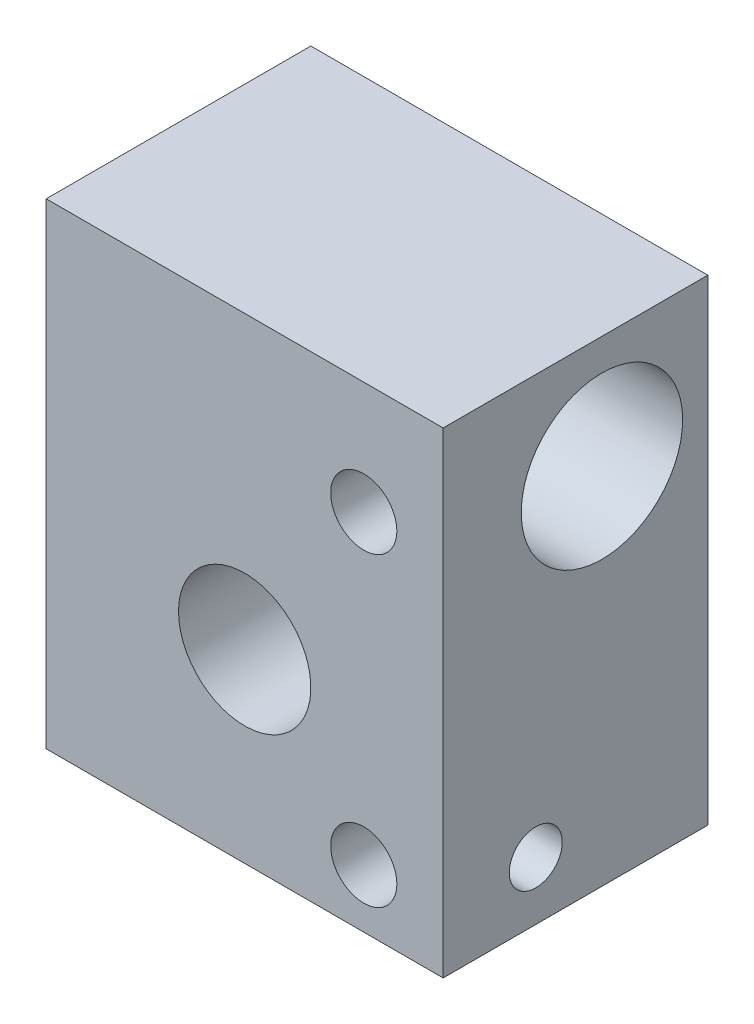
ISO-10303-21;
HEADER;
FILE_DESCRIPTION(('STEP AP214'),'2;1');
FILE_NAME('part.step','',(''),(''),'','','');
FILE_SCHEMA(('AUTOMOTIVE_DESIGN { 1 0 10303 214 1 1 1 1 }'));
ENDSEC;
DATA;
#1=APPLICATION_CONTEXT('core data for automotive mechanical design processes');
#2=APPLICATION_PROTOCOL_DEFINITION('international standard','automotive_design',2000,#1);
#3=PRODUCT_CONTEXT('',#1,'mechanical');
#4=PRODUCT('Part','Part','',(#3));
#5=PRODUCT_RELATED_PRODUCT_CATEGORY('part','',(#4));
#6=PRODUCT_DEFINITION_FORMATION('','',#4);
#7=PRODUCT_DEFINITION_CONTEXT('part definition',#1,'design');
#8=PRODUCT_DEFINITION('design','',#6,#7);
#9=PRODUCT_DEFINITION_SHAPE('','',#8);
#10=(LENGTH_UNIT() NAMED_UNIT(*) SI_UNIT(.MILLI.,.METRE.));
#11=(NAMED_UNIT(*) PLANE_ANGLE_UNIT() SI_UNIT($,.RADIAN.));
#12=(NAMED_UNIT(*) SI_UNIT($,.STERADIAN.) SOLID_ANGLE_UNIT());
#13=UNCERTAINTY_MEASURE_WITH_UNIT(LENGTH_MEASURE(1.E-05),#10,'distance_accuracy_value','');
#14=(GEOMETRIC_REPRESENTATION_CONTEXT(3) GLOBAL_UNCERTAINTY_ASSIGNED_CONTEXT((#13)) GLOBAL_UNIT_ASSIGNED_CONTEXT((#10,
#11,#12)) REPRESENTATION_CONTEXT('',''));
#15=CARTESIAN_POINT('',(0.,0.,0.));
#16=DIRECTION('',(0.,0.,1.));
#17=DIRECTION('',(1.,0.,0.));
#18=AXIS2_PLACEMENT_3D('',#15,#16,#17);
#19=CARTESIAN_POINT('',(7.5,-9.,10.));
#20=DIRECTION('',(-1.,0.,0.));
#21=DIRECTION('',(0.,0.,1.));
#22=AXIS2_PLACEMENT_3D('',#19,#20,#21);
#23=PLANE('',#22);
#24=CARTESIAN_POINT('',(7.5,-6.8,6.5));
#25=DIRECTION('',(1.,0.,0.));
#26=DIRECTION('',(0.,0.,-1.));
#27=AXIS2_PLACEMENT_3D('',#24,#25,#26);
#28=CIRCLE('',#27,0.999999999999998);
#29=CARTESIAN_POINT('',(7.5,-6.8,5.5));
#30=VERTEX_POINT('',#29);
#31=EDGE_CURVE('E109',#30,#30,#28,.T.);
#32=ORIENTED_EDGE('',*,*,#31,.F.);
#33=EDGE_LOOP('',(#32));
#34=FACE_BOUND('',#33,.T.);
#35=CARTESIAN_POINT('',(7.5,4.75,4.));
#36=DIRECTION('',(1.,0.,0.));
#37=DIRECTION('',(0.,0.,-1.));
#38=AXIS2_PLACEMENT_3D('',#35,#36,#37);
#39=CIRCLE('',#38,3.05);
#40=CARTESIAN_POINT('',(7.5,4.75,0.950000000000001));
#41=VERTEX_POINT('',#40);
#42=EDGE_CURVE('E234',#41,#41,#39,.T.);
#43=ORIENTED_EDGE('',*,*,#42,.F.);
#44=EDGE_LOOP('',(#43));
#45=FACE_BOUND('',#44,.T.);
#46=DIRECTION('',(0.,1.,0.));
#47=VECTOR('',#46,1.);
#48=CARTESIAN_POINT('',(7.5,-9.,0.));
#49=LINE('',#48,#47);
#50=CARTESIAN_POINT('',(7.5,-9.,0.));
#51=VERTEX_POINT('',#50);
#52=CARTESIAN_POINT('',(7.5,9.,0.));
#53=VERTEX_POINT('',#52);
#54=EDGE_CURVE('E195',#51,#53,#49,.T.);
#55=ORIENTED_EDGE('',*,*,#54,.T.);
#56=DIRECTION('',(0.,0.,-1.));
#57=VECTOR('',#56,1.);
#58=CARTESIAN_POINT('',(7.5,9.,10.));
#59=LINE('',#58,#57);
#60=CARTESIAN_POINT('',(7.5,9.,10.));
#61=VERTEX_POINT('',#60);
#62=EDGE_CURVE('E140',#61,#53,#59,.T.);
#63=ORIENTED_EDGE('',*,*,#62,.F.);
#64=DIRECTION('',(0.,1.,0.));
#65=VECTOR('',#64,1.);
#66=CARTESIAN_POINT('',(7.5,-9.,10.));
#67=LINE('',#66,#65);
#68=CARTESIAN_POINT('',(7.5,-9.,10.));
#69=VERTEX_POINT('',#68);
#70=EDGE_CURVE('E206',#69,#61,#67,.T.);
#71=ORIENTED_EDGE('',*,*,#70,.F.);
#72=DIRECTION('',(0.,0.,-1.));
#73=VECTOR('',#72,1.);
#74=CARTESIAN_POINT('',(7.5,-9.,10.));
#75=LINE('',#74,#73);
#76=EDGE_CURVE('E210',#69,#51,#75,.T.);
#77=ORIENTED_EDGE('',*,*,#76,.T.);
#78=EDGE_LOOP('',(#55,#63,#71,#77));
#79=FACE_BOUND('',#78,.T.);
#80=ADVANCED_FACE('F38',(#34,#45,#79),#23,.F.);
#81=CARTESIAN_POINT('',(-7.5,9.,10.));
#82=DIRECTION('',(0.,-1.,0.));
#83=DIRECTION('',(0.,0.,-1.));
#84=AXIS2_PLACEMENT_3D('',#81,#82,#83);
#85=PLANE('',#84);
#86=DIRECTION('',(-1.,0.,0.));
#87=VECTOR('',#86,1.);
#88=CARTESIAN_POINT('',(-7.5,9.,0.));
#89=LINE('',#88,#87);
#90=CARTESIAN_POINT('',(-7.5,9.,0.));
#91=VERTEX_POINT('',#90);
#92=EDGE_CURVE('E185',#53,#91,#89,.T.);
#93=ORIENTED_EDGE('',*,*,#92,.T.);
#94=DIRECTION('',(0.,0.,-1.));
#95=VECTOR('',#94,1.);
#96=CARTESIAN_POINT('',(-7.5,9.,10.));
#97=LINE('',#96,#95);
#98=CARTESIAN_POINT('',(-7.5,9.,10.));
#99=VERTEX_POINT('',#98);
#100=EDGE_CURVE('E187',#99,#91,#97,.T.);
#101=ORIENTED_EDGE('',*,*,#100,.F.);
#102=DIRECTION('',(-1.,0.,0.));
#103=VECTOR('',#102,1.);
#104=CARTESIAN_POINT('',(-7.5,9.,10.));
#105=LINE('',#104,#103);
#106=EDGE_CURVE('E220',#61,#99,#105,.T.);
#107=ORIENTED_EDGE('',*,*,#106,.F.);
#108=ORIENTED_EDGE('',*,*,#62,.T.);
#109=EDGE_LOOP('',(#93,#101,#107,#108));
#110=FACE_BOUND('',#109,.T.);
#111=ADVANCED_FACE('F175',(#110),#85,.F.);
#112=CARTESIAN_POINT('',(-7.5,-9.,10.));
#113=DIRECTION('',(1.,0.,0.));
#114=DIRECTION('',(0.,0.,-1.));
#115=AXIS2_PLACEMENT_3D('',#112,#113,#114);
#116=PLANE('',#115);
#117=CARTESIAN_POINT('',(-7.5,4.75,4.));
#118=DIRECTION('',(1.,0.,0.));
#119=DIRECTION('',(0.,0.,-1.));
#120=AXIS2_PLACEMENT_3D('',#117,#118,#119);
#121=CIRCLE('',#120,3.05);
#122=CARTESIAN_POINT('',(-7.5,4.75,0.950000000000001));
#123=VERTEX_POINT('',#122);
#124=EDGE_CURVE('E231',#123,#123,#121,.T.);
#125=ORIENTED_EDGE('',*,*,#124,.T.);
#126=EDGE_LOOP('',(#125));
#127=FACE_BOUND('',#126,.T.);
#128=DIRECTION('',(0.,-1.,0.));
#129=VECTOR('',#128,1.);
#130=CARTESIAN_POINT('',(-7.5,-9.,0.));
#131=LINE('',#130,#129);
#132=CARTESIAN_POINT('',(-7.5,-9.,0.));
#133=VERTEX_POINT('',#132);
#134=EDGE_CURVE('E194',#91,#133,#131,.T.);
#135=ORIENTED_EDGE('',*,*,#134,.T.);
#136=DIRECTION('',(0.,0.,-1.));
#137=VECTOR('',#136,1.);
#138=CARTESIAN_POINT('',(-7.5,-9.,10.));
#139=LINE('',#138,#137);
#140=CARTESIAN_POINT('',(-7.5,-9.,10.));
#141=VERTEX_POINT('',#140);
#142=EDGE_CURVE('E201',#141,#133,#139,.T.);
#143=ORIENTED_EDGE('',*,*,#142,.F.);
#144=DIRECTION('',(0.,-1.,0.));
#145=VECTOR('',#144,1.);
#146=CARTESIAN_POINT('',(-7.5,-9.,10.));
#147=LINE('',#146,#145);
#148=EDGE_CURVE('E200',#99,#141,#147,.T.);
#149=ORIENTED_EDGE('',*,*,#148,.F.);
#150=ORIENTED_EDGE('',*,*,#100,.T.);
#151=EDGE_LOOP('',(#135,#143,#149,#150));
#152=FACE_BOUND('',#151,.T.);
#153=ADVANCED_FACE('F172',(#127,#152),#116,.F.);
#154=CARTESIAN_POINT('',(-7.5,-9.,10.));
#155=DIRECTION('',(0.,1.,0.));
#156=DIRECTION('',(0.,0.,1.));
#157=AXIS2_PLACEMENT_3D('',#154,#155,#156);
#158=PLANE('',#157);
#159=DIRECTION('',(1.,0.,0.));
#160=VECTOR('',#159,1.);
#161=CARTESIAN_POINT('',(-7.5,-9.,0.));
#162=LINE('',#161,#160);
#163=EDGE_CURVE('E204',#133,#51,#162,.T.);
#164=ORIENTED_EDGE('',*,*,#163,.T.);
#165=ORIENTED_EDGE('',*,*,#76,.F.);
#166=DIRECTION('',(1.,0.,0.));
#167=VECTOR('',#166,1.);
#168=CARTESIAN_POINT('',(-7.5,-9.,10.));
#169=LINE('',#168,#167);
#170=EDGE_CURVE('E213',#141,#69,#169,.T.);
#171=ORIENTED_EDGE('',*,*,#170,.F.);
#172=ORIENTED_EDGE('',*,*,#142,.T.);
#173=EDGE_LOOP('',(#164,#165,#171,#172));
#174=FACE_BOUND('',#173,.T.);
#175=ADVANCED_FACE('F165',(#174),#158,.F.);
#176=CARTESIAN_POINT('',(0.,0.,10.));
#177=DIRECTION('',(0.,0.,-1.));
#178=DIRECTION('',(-1.,0.,0.));
#179=AXIS2_PLACEMENT_3D('',#176,#177,#178);
#180=PLANE('',#179);
#181=CARTESIAN_POINT('',(4.5,4.75,10.));
#182=DIRECTION('',(0.,0.,1.));
#183=DIRECTION('',(1.,0.,0.));
#184=AXIS2_PLACEMENT_3D('',#181,#182,#183);
#185=CIRCLE('',#184,1.24999999999999);
#186=CARTESIAN_POINT('',(5.74999999999999,4.75,10.));
#187=VERTEX_POINT('',#186);
#188=EDGE_CURVE('E246',#187,#187,#185,.T.);
#189=ORIENTED_EDGE('',*,*,#188,.F.);
#190=EDGE_LOOP('',(#189));
#191=FACE_BOUND('',#190,.T.);
#192=CARTESIAN_POINT('',(4.5,-6.8,10.));
#193=DIRECTION('',(0.,0.,1.));
#194=DIRECTION('',(1.,0.,0.));
#195=AXIS2_PLACEMENT_3D('',#192,#193,#194);
#196=CIRCLE('',#195,1.24999999999999);
#197=CARTESIAN_POINT('',(5.74999999999999,-6.8,10.));
#198=VERTEX_POINT('',#197);
#199=EDGE_CURVE('E244',#198,#198,#196,.T.);
#200=ORIENTED_EDGE('',*,*,#199,.F.);
#201=EDGE_LOOP('',(#200));
#202=FACE_BOUND('',#201,.T.);
#203=CARTESIAN_POINT('',(0.,-2.,10.));
#204=DIRECTION('',(0.,0.,-1.));
#205=DIRECTION('',(-1.,0.,0.));
#206=AXIS2_PLACEMENT_3D('',#203,#204,#205);
#207=CIRCLE('',#206,2.5);
#208=CARTESIAN_POINT('',(-2.5,-2.,10.));
#209=VERTEX_POINT('',#208);
#210=EDGE_CURVE('E223',#209,#209,#207,.T.);
#211=ORIENTED_EDGE('',*,*,#210,.T.);
#212=EDGE_LOOP('',(#211));
#213=FACE_BOUND('',#212,.T.);
#214=ORIENTED_EDGE('',*,*,#70,.T.);
#215=ORIENTED_EDGE('',*,*,#106,.T.);
#216=ORIENTED_EDGE('',*,*,#148,.T.);
#217=ORIENTED_EDGE('',*,*,#170,.T.);
#218=EDGE_LOOP('',(#214,#215,#216,#217));
#219=FACE_BOUND('',#218,.T.);
#220=ADVANCED_FACE('F162',(#191,#202,#213,#219),#180,.F.);
#221=CARTESIAN_POINT('',(0.,0.,0.));
#222=DIRECTION('',(0.,0.,-1.));
#223=DIRECTION('',(-1.,0.,0.));
#224=AXIS2_PLACEMENT_3D('',#221,#222,#223);
#225=PLANE('',#224);
#226=CARTESIAN_POINT('',(0.,-2.,0.));
#227=DIRECTION('',(0.,0.,-1.));
#228=DIRECTION('',(-1.,0.,0.));
#229=AXIS2_PLACEMENT_3D('',#226,#227,#228);
#230=CIRCLE('',#229,2.5);
#231=CARTESIAN_POINT('',(-2.5,-2.,0.));
#232=VERTEX_POINT('',#231);
#233=EDGE_CURVE('E226',#232,#232,#230,.T.);
#234=ORIENTED_EDGE('',*,*,#233,.F.);
#235=EDGE_LOOP('',(#234));
#236=FACE_BOUND('',#235,.T.);
#237=ORIENTED_EDGE('',*,*,#54,.F.);
#238=ORIENTED_EDGE('',*,*,#163,.F.);
#239=ORIENTED_EDGE('',*,*,#134,.F.);
#240=ORIENTED_EDGE('',*,*,#92,.F.);
#241=EDGE_LOOP('',(#237,#238,#239,#240));
#242=FACE_BOUND('',#241,.T.);
#243=ADVANCED_FACE('F160',(#236,#242),#225,.T.);
#244=CARTESIAN_POINT('',(0.,-2.,10.));
#245=DIRECTION('',(0.,0.,-1.));
#246=DIRECTION('',(-1.,0.,0.));
#247=AXIS2_PLACEMENT_3D('',#244,#245,#246);
#248=CYLINDRICAL_SURFACE('',#247,2.5);
#249=ORIENTED_EDGE('',*,*,#210,.F.);
#250=EDGE_LOOP('',(#249));
#251=FACE_BOUND('',#250,.T.);
#252=ORIENTED_EDGE('',*,*,#233,.T.);
#253=EDGE_LOOP('',(#252));
#254=FACE_BOUND('',#253,.T.);
#255=ADVANCED_FACE('F156',(#251,#254),#248,.F.);
#256=CARTESIAN_POINT('',(-7.5,4.75,4.));
#257=DIRECTION('',(1.,0.,0.));
#258=DIRECTION('',(0.,0.,-1.));
#259=AXIS2_PLACEMENT_3D('',#256,#257,#258);
#260=CYLINDRICAL_SURFACE('',#259,3.05);
#261=CARTESIAN_POINT('',(5.74999999999999,4.75,7.05));
#262=CARTESIAN_POINT('',(5.74999317358084,4.81705105449435,7.0499949013604));
#263=CARTESIAN_POINT('',(5.7445728904159,4.88421220939516,7.04776316601173));
#264=CARTESIAN_POINT('',(5.7230821427269,5.01663531512961,7.03905220749816));
#265=CARTESIAN_POINT('',(5.7069833965083,5.08189174087961,7.0325617055695));
#266=CARTESIAN_POINT('',(5.66482596800735,5.20837429284752,7.01603149034563));
#267=CARTESIAN_POINT('',(5.63880056530878,5.2696130929358,7.00600364451595));
#268=CARTESIAN_POINT('',(5.57766372514542,5.38679775394015,6.98337979201622));
#269=CARTESIAN_POINT('',(5.54255520538643,5.44274530666015,6.97078461030852));
#270=CARTESIAN_POINT('',(5.46243359833868,5.55058268229026,6.94360272183732));
#271=CARTESIAN_POINT('',(5.41704813784625,5.60217961883631,6.92895218720805));
#272=CARTESIAN_POINT('',(5.31844769395315,5.69727980579278,6.8995935820288));
#273=CARTESIAN_POINT('',(5.26522873562099,5.74077892161812,6.88488548598071));
#274=CARTESIAN_POINT('',(5.1494220879687,5.82047635819198,6.85630174305004));
#275=CARTESIAN_POINT('',(5.08651058665788,5.85623272255294,6.84249824263373));
#276=CARTESIAN_POINT('',(4.95491722684178,5.91652509902148,6.81829427065235));
#277=CARTESIAN_POINT('',(4.88623826542879,5.9410667050528,6.80789210323986));
#278=CARTESIAN_POINT('',(4.74842884283273,5.977033698322,6.79235707938262));
#279=CARTESIAN_POINT('',(4.67947149284317,5.98902161527503,6.78699943260884));
#280=CARTESIAN_POINT('',(4.54033187566907,6.00129693566521,6.78151145539133));
#281=CARTESIAN_POINT('',(4.47015027248522,6.00159049579919,6.78137837438494));
#282=CARTESIAN_POINT('',(4.33607409840986,5.99089353762405,6.78616368996563));
#283=CARTESIAN_POINT('',(4.27209740726591,5.98073314256808,6.79071047916049));
#284=CARTESIAN_POINT('',(4.14685271703793,5.95080567936669,6.80371701324258));
#285=CARTESIAN_POINT('',(4.08558521945647,5.93103684064336,6.81217747930138));
#286=CARTESIAN_POINT('',(3.96597856734735,5.88207159424284,6.83224715740189));
#287=CARTESIAN_POINT('',(3.90772757534972,5.85268647565431,6.84391858333761));
#288=CARTESIAN_POINT('',(3.79676189319712,5.78545581744839,6.8690795378448));
#289=CARTESIAN_POINT('',(3.74404935655718,5.7476070046597,6.88256976900067));
#290=CARTESIAN_POINT('',(3.64113506271575,5.66089979031177,6.91118669367846));
#291=CARTESIAN_POINT('',(3.59148817119212,5.61139546177047,6.92635714795841));
#292=CARTESIAN_POINT('',(3.50101833818234,5.50460843164101,6.95569448523891));
#293=CARTESIAN_POINT('',(3.46019733238115,5.44732402821036,6.96986114763168));
#294=CARTESIAN_POINT('',(3.38776019476994,5.32496342854657,6.99598214323011));
#295=CARTESIAN_POINT('',(3.35636271935724,5.25974527572702,7.00788187819974));
#296=CARTESIAN_POINT('',(3.30517803112997,5.12434088842293,7.02771185130719));
#297=CARTESIAN_POINT('',(3.28538461664024,5.05415733016857,7.03564420943661));
#298=CARTESIAN_POINT('',(3.25911499785756,4.91545720041041,7.04625363825052));
#299=CARTESIAN_POINT('',(3.25189372784432,4.84710415103708,7.04922426910946));
#300=CARTESIAN_POINT('',(3.24876092149755,4.71010441371817,7.0505074612745));
#301=CARTESIAN_POINT('',(3.25284627086616,4.64145781182913,7.04882130524732));
#302=CARTESIAN_POINT('',(3.27167121733155,4.50926209998629,7.04117156509262));
#303=CARTESIAN_POINT('',(3.28589367478943,4.44562598291882,7.03541570476584));
#304=CARTESIAN_POINT('',(3.32387605471634,4.32170816248345,7.02042451329165));
#305=CARTESIAN_POINT('',(3.34763719121059,4.26142688721188,7.01118873925112));
#306=CARTESIAN_POINT('',(3.40479928404273,4.14383011012163,6.98977295322551));
#307=CARTESIAN_POINT('',(3.43847544195124,4.08666382302296,6.97751077732146));
#308=CARTESIAN_POINT('',(3.51420811639302,3.97859041874229,6.95135965585715));
#309=CARTESIAN_POINT('',(3.55626807827196,3.92768588879936,6.93747004246777));
#310=CARTESIAN_POINT('',(3.65098440399942,3.82987991098666,6.9083776173988));
#311=CARTESIAN_POINT('',(3.70417275944046,3.78349954211682,6.89315046142814));
#312=CARTESIAN_POINT('',(3.81783195761042,3.70018452435906,6.86397295744693));
#313=CARTESIAN_POINT('',(3.87830425548019,3.66325176747518,6.85002286554325));
#314=CARTESIAN_POINT('',(4.00591935720062,3.59955272757804,6.82491824303052));
#315=CARTESIAN_POINT('',(4.0731350035576,3.57291696039833,6.8138001745101));
#316=CARTESIAN_POINT('',(4.21169404128461,3.53156002386075,6.79614362783963));
#317=CARTESIAN_POINT('',(4.28303413036749,3.51682946022231,6.78960153937764));
#318=CARTESIAN_POINT('',(4.42205571719578,3.50061997017984,6.78237686582237));
#319=CARTESIAN_POINT('',(4.48961071540186,3.49823064874135,6.78129189039514));
#320=CARTESIAN_POINT('',(4.62411541510115,3.50435741732201,6.78404131006805));
#321=CARTESIAN_POINT('',(4.6910652011546,3.51287195937366,6.7878750068888));
#322=CARTESIAN_POINT('',(4.8194595845332,3.53980857539514,6.79966724973414));
#323=CARTESIAN_POINT('',(4.88101694579431,3.55778270632242,6.80743875303861));
#324=CARTESIAN_POINT('',(5.00026093044537,3.60269826055876,6.82609039777681));
#325=CARTESIAN_POINT('',(5.0579464682445,3.62964218632339,6.83697140660187));
#326=CARTESIAN_POINT('',(5.17152052867124,3.69356546820026,6.86141244323642));
#327=CARTESIAN_POINT('',(5.22710231558399,3.73104304994741,6.87509264152988));
#328=CARTESIAN_POINT('',(5.33147333634056,3.81425954659735,6.90324259102355));
#329=CARTESIAN_POINT('',(5.38026033074679,3.8600011738197,6.91771260035406));
#330=CARTESIAN_POINT('',(5.47314082024466,3.96222488066987,6.94701985281455));
#331=CARTESIAN_POINT('',(5.51667265144533,4.0192324065468,6.961812751821));
#332=CARTESIAN_POINT('',(5.59357367951555,4.14029737005191,6.98908126299053));
#333=CARTESIAN_POINT('',(5.6269382146159,4.20435802331352,7.00155581115557));
#334=CARTESIAN_POINT('',(5.68180811191665,4.33663629870453,7.02258806460315));
#335=CARTESIAN_POINT('',(5.70351052450805,4.40476171520484,7.03121040731175));
#336=CARTESIAN_POINT('',(5.73495872650017,4.54399616753341,7.04383134859934));
#337=CARTESIAN_POINT('',(5.74474216568277,4.61509507070934,7.04784450441534));
#338=CARTESIAN_POINT('',(5.74946289651355,4.70760124338892,7.04978053015449));
#339=CARTESIAN_POINT('',(5.75000215885384,4.72879511590617,7.05000161244387));
#340=CARTESIAN_POINT('',(5.74999999999999,4.75,7.05));
#341=B_SPLINE_CURVE_WITH_KNOTS('',3,(#261,#262,#263,#264,#265,#266,#267,#268,#269,#270,#271,
#272,#273,#274,#275,#276,#277,#278,#279,#280,#281,#282,#283,#284,#285,#286,#287,#288,#289,#290,
#291,#292,#293,#294,#295,#296,#297,#298,#299,#300,#301,#302,#303,#304,#305,#306,#307,#308,#309,
#310,#311,#312,#313,#314,#315,#316,#317,#318,#319,#320,#321,#322,#323,#324,#325,#326,#327,#328,
#329,#330,#331,#332,#333,#334,#335,#336,#337,#338,#339,#340),.UNSPECIFIED.,.T.,.F.,(4,2,2,2,2,2,
2,2,2,2,2,2,2,2,2,2,2,2,2,2,2,2,2,2,2,2,2,2,2,2,2,2,2,2,2,2,2,2,2,4),(0.,0.201094311180327,
0.402723354574274,0.60368228554281,0.804576743863707,1.01444492091329,1.22441996030868,
1.44431409976959,1.66409843594336,1.87354721803841,2.08288573073389,2.27679448285735,
2.47073898070664,2.66874390795883,2.86682554265503,3.08105274490332,3.29532688370776,
3.51424468844056,3.73304538781654,3.93837132545348,4.14364071369572,4.33912550528581,
4.53463518488672,4.73618655641969,4.93782092740471,5.15341391236424,5.36905003881043,
5.58733616568886,5.80544987646513,6.00721727204662,6.20895602688514,6.40190297186301,
6.59490379169176,6.79928960640031,7.00374262427848,7.22240178249367,7.44116104698124,
7.65609749208749,7.87035321839582,7.93394925864703),.UNSPECIFIED.);
#342=CARTESIAN_POINT('',(5.74999999999999,4.75,7.05));
#343=VERTEX_POINT('',#342);
#344=EDGE_CURVE('E141',#343,#343,#341,.T.);
#345=ORIENTED_EDGE('',*,*,#344,.T.);
#346=EDGE_LOOP('',(#345));
#347=FACE_BOUND('',#346,.T.);
#348=ORIENTED_EDGE('',*,*,#124,.F.);
#349=EDGE_LOOP('',(#348));
#350=FACE_BOUND('',#349,.T.);
#351=ORIENTED_EDGE('',*,*,#42,.T.);
#352=EDGE_LOOP('',(#351));
#353=FACE_BOUND('',#352,.T.);
#354=ADVANCED_FACE('F150',(#347,#350,#353),#260,.F.);
#355=CARTESIAN_POINT('',(4.5,-6.8,6.));
#356=DIRECTION('',(0.,0.,1.));
#357=DIRECTION('',(1.,0.,0.));
#358=AXIS2_PLACEMENT_3D('',#355,#356,#357);
#359=CONICAL_SURFACE('',#358,1.25,1.02974425867665);
#360=CARTESIAN_POINT('',(4.5,-6.8,5.24892422621555));
#361=VERTEX_POINT('',#360);
#362=VERTEX_LOOP('',#361);
#363=FACE_BOUND('',#362,.T.);
#364=CARTESIAN_POINT('',(4.5,-6.8,6.));
#365=DIRECTION('',(0.,0.,1.));
#366=DIRECTION('',(1.,0.,0.));
#367=AXIS2_PLACEMENT_3D('',#364,#365,#366);
#368=CIRCLE('',#367,1.25);
#369=CARTESIAN_POINT('',(3.598612181134,-7.66602540378443,6.));
#370=VERTEX_POINT('',#369);
#371=CARTESIAN_POINT('',(5.40138781886869,-7.66602540378681,6.00000000000196));
#372=VERTEX_POINT('',#371);
#373=EDGE_CURVE('E243',#370,#372,#368,.T.);
#374=ORIENTED_EDGE('',*,*,#373,.T.);
#375=CARTESIAN_POINT('',(5.49028641707355,-7.69312930754734,6.0502));
#376=CARTESIAN_POINT('',(5.4620540291597,-7.68516229364402,6.03439446403427));
#377=CARTESIAN_POINT('',(5.43397441822092,-7.67667040293627,6.01856440625544));
#378=CARTESIAN_POINT('',(5.37820933805071,-7.65846567832842,5.98679857880335));
#379=CARTESIAN_POINT('',(5.35052460000254,-7.64875084220868,5.97086267732073));
#380=CARTESIAN_POINT('',(5.29534164443274,-7.62780610981277,5.93865263805377));
#381=CARTESIAN_POINT('',(5.26785172041543,-7.6165565790724,5.92237691803523));
#382=CARTESIAN_POINT('',(5.21372068820972,-7.59240944996764,5.88967177107602));
#383=CARTESIAN_POINT('',(5.18707899740181,-7.5795130147024,5.87324246012328));
#384=CARTESIAN_POINT('',(5.13220243909832,-7.55021227801001,5.83836852135706));
#385=CARTESIAN_POINT('',(5.10410431543777,-7.53357989189848,5.8198971567474));
#386=CARTESIAN_POINT('',(5.05034517125699,-7.49710879666876,5.78255861572174));
#387=CARTESIAN_POINT('',(5.02467984624535,-7.47727592504741,5.76369221334503));
#388=CARTESIAN_POINT('',(4.98483989175455,-7.43999201796968,5.73135380836441));
#389=CARTESIAN_POINT('',(4.96954941989286,-7.4236625107789,5.71799347162254));
#390=CARTESIAN_POINT('',(4.94218478884379,-7.38857975994309,5.6912618305678));
#391=CARTESIAN_POINT('',(4.93009685493828,-7.36983742938766,5.67789082979815));
#392=CARTESIAN_POINT('',(4.91016740799821,-7.329590146974,5.65140304199133));
#393=CARTESIAN_POINT('',(4.90238168548031,-7.3080531773224,5.63829162851512));
#394=CARTESIAN_POINT('',(4.89169708291768,-7.26309379111954,5.61331666161574));
#395=CARTESIAN_POINT('',(4.88881009238113,-7.23966693149489,5.60145620952708));
#396=CARTESIAN_POINT('',(4.88623771053257,-7.18102854252964,5.57464593497841));
#397=CARTESIAN_POINT('',(4.8886037228914,-7.14530002689939,5.56074189203022));
#398=CARTESIAN_POINT('',(4.89581292295022,-7.07266926803107,5.53712400838137));
#399=CARTESIAN_POINT('',(4.90066989969421,-7.03576157518701,5.52743405299092));
#400=CARTESIAN_POINT('',(4.91006860539325,-6.95380542606474,5.51086100553405));
#401=CARTESIAN_POINT('',(4.91437678220478,-6.90853802728334,5.50485597158092));
#402=CARTESIAN_POINT('',(4.9184748067492,-6.81754799344687,5.49912238604378));
#403=CARTESIAN_POINT('',(4.91828328292789,-6.77182801826922,5.49936795774198));
#404=CARTESIAN_POINT('',(4.91341881342609,-6.67863261058294,5.50622854677725));
#405=CARTESIAN_POINT('',(4.90849830019974,-6.63120016203335,5.51319551359828));
#406=CARTESIAN_POINT('',(4.8974167784806,-6.53776947303589,5.53380349357297));
#407=CARTESIAN_POINT('',(4.89125185371857,-6.4917763035517,5.54746577626934));
#408=CARTESIAN_POINT('',(4.88715963497418,-6.42244524242514,5.57365031385066));
#409=CARTESIAN_POINT('',(4.88674774685179,-6.39841640858867,5.58380701297793));
#410=CARTESIAN_POINT('',(4.88976593975288,-6.3515349652331,5.60582909571334));
#411=CARTESIAN_POINT('',(4.89316735273016,-6.32867491195563,5.61768115280812));
#412=CARTESIAN_POINT('',(4.90481955461782,-6.28460383870021,5.642669092288));
#413=CARTESIAN_POINT('',(4.91312257269359,-6.26341340810177,5.65581751190304));
#414=CARTESIAN_POINT('',(4.93411194219538,-6.22351706477168,5.68253382279197));
#415=CARTESIAN_POINT('',(4.94682115498955,-6.20482482880032,5.69610355897556));
#416=CARTESIAN_POINT('',(4.98149614630583,-6.16232995685965,5.72903491275924));
#417=CARTESIAN_POINT('',(5.00508221426013,-6.13985006830772,5.74834355388397));
#418=CARTESIAN_POINT('',(5.05581374943648,-6.09868488061901,5.78659230699454));
#419=CARTESIAN_POINT('',(5.08298397356535,-6.08002851866166,5.80552869364956));
#420=CARTESIAN_POINT('',(5.14072146790836,-6.04479770679221,5.84396632214518));
#421=CARTESIAN_POINT('',(5.1713904277386,-6.02837263772575,5.86344892060987));
#422=CARTESIAN_POINT('',(5.23412643971758,-5.99799989181846,5.90217002760717));
#423=CARTESIAN_POINT('',(5.26619554023356,-5.98405600718381,5.92140812147574));
#424=CARTESIAN_POINT('',(5.3300143351173,-5.95868810757523,5.95899211536545));
#425=CARTESIAN_POINT('',(5.36173093611331,-5.94718922450714,5.97734442596747));
#426=CARTESIAN_POINT('',(5.4256642289682,-5.92585951930255,6.0138744249624));
#427=CARTESIAN_POINT('',(5.45787881496915,-5.91602307251018,6.03205249756596));
#428=CARTESIAN_POINT('',(5.49028641707356,-5.90687069245265,6.05019999999999));
#429=B_SPLINE_CURVE_WITH_KNOTS('',3,(#375,#376,#377,#378,#379,#380,#381,#382,#383,#384,#385,
#386,#387,#388,#389,#390,#391,#392,#393,#394,#395,#396,#397,#398,#399,#400,#401,#402,#403,#404,
#405,#406,#407,#408,#409,#410,#411,#412,#413,#414,#415,#416,#417,#418,#419,#420,#421,#422,#423,
#424,#425,#426,#427,#428),.UNSPECIFIED.,.F.,.F.,(4,2,2,2,2,2,2,2,2,2,2,2,2,2,2,2,2,2,2,2,2,2,2,
2,2,2,4),(0.,0.0999728954722889,0.200111649914622,0.301678803220385,0.403174619034599,
0.515584481665867,0.627791585764168,0.705740491157839,0.783348470749543,0.861940559971286,
0.940723125374583,1.05531115599276,1.17054046158092,1.30757349647233,1.44403932453253,
1.58806182841255,1.73254485532535,1.81057795926005,1.88802832841069,1.96631925883886,
2.04502263303189,2.15802352730949,2.27185038942399,2.39132944073084,2.51098956226303,
2.62616392516715,2.74094044998118),.UNSPECIFIED.);
#430=CARTESIAN_POINT('',(5.401387818866,-5.93397459621556,6.));
#431=VERTEX_POINT('',#430);
#432=EDGE_CURVE('E11',#372,#431,#429,.T.);
#433=ORIENTED_EDGE('',*,*,#432,.T.);
#434=CARTESIAN_POINT('',(3.59861218113131,-5.93397459621319,6.00000000000196));
#435=VERTEX_POINT('',#434);
#436=EDGE_CURVE('E238',#431,#435,#368,.T.);
#437=ORIENTED_EDGE('',*,*,#436,.T.);
#438=CARTESIAN_POINT('',(3.50971358292644,-5.90687069245266,6.0502));
#439=CARTESIAN_POINT('',(3.53331315066842,-5.91352483721161,6.03699153619936));
#440=CARTESIAN_POINT('',(3.5567997123455,-5.92055093156863,6.02376501618166));
#441=CARTESIAN_POINT('',(3.60349741941,-5.9354342598509,5.99724961432135));
#442=CARTESIAN_POINT('',(3.62670833949662,-5.943292127758,5.98396069239589));
#443=CARTESIAN_POINT('',(3.69717031261121,-5.96872321181211,5.94319816564678));
#444=CARTESIAN_POINT('',(3.7438358110887,-5.98776882275197,5.91561372999426));
#445=CARTESIAN_POINT('',(3.83471240297246,-6.03095640395233,5.85981688611285));
#446=CARTESIAN_POINT('',(3.87891676344681,-6.05511156272037,5.83160302516138));
#447=CARTESIAN_POINT('',(3.94083716089381,-6.09681482391588,5.78872178686289));
#448=CARTESIAN_POINT('',(3.96066329263914,-6.11154589536983,5.77440315102412));
#449=CARTESIAN_POINT('',(3.99813510882635,-6.14332035661841,5.74552415052808));
#450=CARTESIAN_POINT('',(4.01578567575378,-6.16035838166081,5.73096441352294));
#451=CARTESIAN_POINT('',(4.04652590778618,-6.19591099573206,5.70278607647913));
#452=CARTESIAN_POINT('',(4.05985910623184,-6.21421741426561,5.68917928098483));
#453=CARTESIAN_POINT('',(4.08226510274055,-6.2533626627292,5.66229859506211));
#454=CARTESIAN_POINT('',(4.09136422741643,-6.27418480156528,5.64902314678261));
#455=CARTESIAN_POINT('',(4.10464310673414,-6.31793974424823,5.62349687802884));
#456=CARTESIAN_POINT('',(4.10881781004169,-6.34087468940767,5.61124712162209));
#457=CARTESIAN_POINT('',(4.11306265600131,-6.38806657508964,5.58840380415463));
#458=CARTESIAN_POINT('',(4.11309881514464,-6.41233282411698,5.57782466777655));
#459=CARTESIAN_POINT('',(4.11081909538787,-6.46046097284519,5.55906713984957));
#460=CARTESIAN_POINT('',(4.10859993826292,-6.48429842321439,5.55080787372999));
#461=CARTESIAN_POINT('',(4.10335614543742,-6.53246306784323,5.5361231670742));
#462=CARTESIAN_POINT('',(4.1003306042383,-6.55679078406327,5.52969980500596));
#463=CARTESIAN_POINT('',(4.09451085196856,-6.60579562257214,5.51871894904032));
#464=CARTESIAN_POINT('',(4.09171580951763,-6.63047107603481,5.51415449234926));
#465=CARTESIAN_POINT('',(4.08702679450586,-6.68017771334998,5.50688722680716));
#466=CARTESIAN_POINT('',(4.08513254220297,-6.70520878427462,5.50418383988055));
#467=CARTESIAN_POINT('',(4.08254750308201,-6.75738125016416,5.5005412204046));
#468=CARTESIAN_POINT('',(4.08195889631627,-6.78453870485979,5.49975135089749));
#469=CARTESIAN_POINT('',(4.08241996599582,-6.83881884917334,5.50038504756375));
#470=CARTESIAN_POINT('',(4.08347004507912,-6.86594152860778,5.50180915772903));
#471=CARTESIAN_POINT('',(4.08697842937304,-6.92002793067094,5.5068557657891));
#472=CARTESIAN_POINT('',(4.0894441853843,-6.94699004361226,5.51048990123161));
#473=CARTESIAN_POINT('',(4.09516019310819,-7.00043858924834,5.51991792137252));
#474=CARTESIAN_POINT('',(4.09841040229522,-7.02692504764496,5.52571168900542));
#475=CARTESIAN_POINT('',(4.10519576081253,-7.08368196745147,5.54056108147484));
#476=CARTESIAN_POINT('',(4.10868992530325,-7.11385875777519,5.54999633842318));
#477=CARTESIAN_POINT('',(4.11285630884389,-7.17325822177271,5.57174106146463));
#478=CARTESIAN_POINT('',(4.11354654398704,-7.20248578590847,5.58403163962699));
#479=CARTESIAN_POINT('',(4.1096980334543,-7.25174952014176,5.60755661353824));
#480=CARTESIAN_POINT('',(4.10650824550244,-7.2721535088778,5.61819452914818));
#481=CARTESIAN_POINT('',(4.09631900767154,-7.31145889668883,5.64039608881511));
#482=CARTESIAN_POINT('',(4.08932129327637,-7.33036097577355,5.65195930911316));
#483=CARTESIAN_POINT('',(4.07187333548009,-7.36609999506259,5.67538611754454));
#484=CARTESIAN_POINT('',(4.06143983303491,-7.3829464164912,5.6872479966086));
#485=CARTESIAN_POINT('',(4.0379304302771,-7.41469361637308,5.71098474345566));
#486=CARTESIAN_POINT('',(4.02484833016169,-7.42958969221195,5.72285957546288));
#487=CARTESIAN_POINT('',(3.98245149583499,-7.47213854501448,5.75863019433972));
#488=CARTESIAN_POINT('',(3.95030629956501,-7.49711016597753,5.78229754158439));
#489=CARTESIAN_POINT('',(3.88231649195085,-7.54225642438731,5.82909749644401));
#490=CARTESIAN_POINT('',(3.84644852850505,-7.5623977869094,5.85222545652559));
#491=CARTESIAN_POINT('',(3.76145323607756,-7.60471990904869,5.90510677052084));
#492=CARTESIAN_POINT('',(3.71162145890342,-7.62564542244421,5.93472675232658));
#493=CARTESIAN_POINT('',(3.636071292196,-7.65346919608147,5.97858123510041));
#494=CARTESIAN_POINT('',(3.61102171575906,-7.66207715135555,5.9929551794052));
#495=CARTESIAN_POINT('',(3.56059863176369,-7.67831041892385,6.02162556712644));
#496=CARTESIAN_POINT('',(3.53522548724744,-7.68593674144481,6.03592207547788));
#497=CARTESIAN_POINT('',(3.50971358292644,-7.69312930754734,6.0502));
#498=B_SPLINE_CURVE_WITH_KNOTS('',3,(#438,#439,#440,#441,#442,#443,#444,#445,#446,#447,#448,
#449,#450,#451,#452,#453,#454,#455,#456,#457,#458,#459,#460,#461,#462,#463,#464,#465,#466,#467,
#468,#469,#470,#471,#472,#473,#474,#475,#476,#477,#478,#479,#480,#481,#482,#483,#484,#485,#486,
#487,#488,#489,#490,#491,#492,#493,#494,#495,#496,#497),.UNSPECIFIED.,.F.,.F.,(4,2,2,2,2,2,2,2,
2,2,2,2,2,2,2,2,2,2,2,2,2,2,2,2,2,2,2,2,2,4),(0.,0.0835520453506485,0.167168239405998,
0.339378728614747,0.512039264477075,0.597570075986015,0.682905298970882,0.761806801456588,
0.840210929777046,0.918695413123635,0.997824323169111,1.07369719179067,1.14965562058719,
1.22532686000053,1.30097458419883,1.38236014465604,1.46376570533486,1.54560368850048,
1.62743723618381,1.72272259273378,1.81739473431565,1.88674994840292,1.95607357990292,
2.02506430849321,2.09421843665384,2.23466803413924,2.37605903144819,2.5606240898532,
2.65102370647571,2.74132953346726),.UNSPECIFIED.);
#499=EDGE_CURVE('E51',#435,#370,#498,.T.);
#500=ORIENTED_EDGE('',*,*,#499,.T.);
#501=EDGE_LOOP('',(#374,#433,#437,#500));
#502=FACE_BOUND('',#501,.T.);
#503=ADVANCED_FACE('F147',(#363,#502),#359,.F.);
#504=CARTESIAN_POINT('',(4.5,-6.8,10.));
#505=DIRECTION('',(0.,0.,1.));
#506=DIRECTION('',(1.,0.,0.));
#507=AXIS2_PLACEMENT_3D('',#504,#505,#506);
#508=CYLINDRICAL_SURFACE('',#507,1.24999999999999);
#509=ORIENTED_EDGE('',*,*,#373,.F.);
#510=CARTESIAN_POINT('',(3.59861218113401,-7.66602540378443,6.));
#511=CARTESIAN_POINT('',(3.6184739762057,-7.68675902626416,6.03596487697014));
#512=CARTESIAN_POINT('',(3.63792426677372,-7.70550837472696,6.07356604043001));
#513=CARTESIAN_POINT('',(3.67420457060918,-7.73869615813151,6.15254086986226));
#514=CARTESIAN_POINT('',(3.69099237800154,-7.75306795614247,6.19396143451628));
#515=CARTESIAN_POINT('',(3.71662484017291,-7.774191046944,6.27147824029317));
#516=CARTESIAN_POINT('',(3.72638490183204,-7.78188898138144,6.30699782754954));
#517=CARTESIAN_POINT('',(3.74119250823732,-7.79337834014281,6.37944342339025));
#518=CARTESIAN_POINT('',(3.74626821333322,-7.7971931227873,6.41635962027606));
#519=CARTESIAN_POINT('',(3.75087623406768,-7.80066203387391,6.49104013185147));
#520=CARTESIAN_POINT('',(3.7503659702569,-7.80028420352463,6.52880876791995));
#521=CARTESIAN_POINT('',(3.74379868009988,-7.79532595045897,6.60363042555023));
#522=CARTESIAN_POINT('',(3.73772850144248,-7.79073556263663,6.64068153745415));
#523=CARTESIAN_POINT('',(3.71917407194171,-7.7762048970141,6.72156369670487));
#524=CARTESIAN_POINT('',(3.70551473903188,-7.7652582085766,6.76493288121588));
#525=CARTESIAN_POINT('',(3.67391866748519,-7.7383604281203,6.84844802500106));
#526=CARTESIAN_POINT('',(3.65597022712357,-7.72239560717476,6.88858475769217));
#527=CARTESIAN_POINT('',(3.60917119928421,-7.67771680229838,6.98318071024624));
#528=CARTESIAN_POINT('',(3.57907694975281,-7.64650740694967,7.03584310834097));
#529=CARTESIAN_POINT('',(3.5183559128812,-7.57529354321466,7.13452506969512));
#530=CARTESIAN_POINT('',(3.4877285307973,-7.53527858397908,7.18053659992188));
#531=CARTESIAN_POINT('',(3.42850448445096,-7.44599465399415,7.26586751507779));
#532=CARTESIAN_POINT('',(3.39994062620079,-7.3966085923144,7.30508869960434));
#533=CARTESIAN_POINT('',(3.34824880857564,-7.28936992436963,7.37439063704452));
#534=CARTESIAN_POINT('',(3.32510309630992,-7.23154600583372,7.40450133866137));
#535=CARTESIAN_POINT('',(3.29321706824316,-7.1287352289244,7.4454787311362));
#536=CARTESIAN_POINT('',(3.28223911477027,-7.08565789198627,7.45941959553146));
#537=CARTESIAN_POINT('',(3.2648228483799,-6.99714123564449,7.48143202454589));
#538=CARTESIAN_POINT('',(3.25838106982787,-6.95170374795623,7.48950807003057));
#539=CARTESIAN_POINT('',(3.25055997532031,-6.85954328009454,7.49930431849854));
#540=CARTESIAN_POINT('',(3.24919867951823,-6.81281631522798,7.50100189760592));
#541=CARTESIAN_POINT('',(3.25171166139105,-6.7197235050632,7.49786005964921));
#542=CARTESIAN_POINT('',(3.25558637936792,-6.67335769046427,7.49302009283597));
#543=CARTESIAN_POINT('',(3.26789644071195,-6.58478275906894,7.47754770761949));
#544=CARTESIAN_POINT('',(3.27608478095272,-6.54248278388333,7.46722878915105));
#545=CARTESIAN_POINT('',(3.29626920480038,-6.46041183970799,7.44155751906085));
#546=CARTESIAN_POINT('',(3.30826626745011,-6.42064152413306,7.42620387321483));
#547=CARTESIAN_POINT('',(3.33662734477677,-6.34061610275749,7.38943026475194));
#548=CARTESIAN_POINT('',(3.3532975400543,-6.30067249548245,7.36757318159561));
#549=CARTESIAN_POINT('',(3.38933145605348,-6.22495505790292,7.3193541579962));
#550=CARTESIAN_POINT('',(3.40869664925647,-6.18918352689241,7.29298975305069));
#551=CARTESIAN_POINT('',(3.45329012101718,-6.11506815716582,7.23053201378272));
#552=CARTESIAN_POINT('',(3.47890562257895,-6.07770544720324,7.1935526776411));
#553=CARTESIAN_POINT('',(3.53087218655124,-6.00934523514016,7.11449333600249));
#554=CARTESIAN_POINT('',(3.55722412508303,-5.97835571614283,7.07240703709845));
#555=CARTESIAN_POINT('',(3.60622712533196,-5.92544257606388,6.98727271180081));
#556=CARTESIAN_POINT('',(3.62899882820422,-5.90295754665743,6.94464367185246));
#557=CARTESIAN_POINT('',(3.67109389715927,-5.8639261797273,6.85515927976932));
#558=CARTESIAN_POINT('',(3.69042463040289,-5.84736707594537,6.80831328827332));
#559=CARTESIAN_POINT('',(3.7174904197567,-5.82512107880842,6.72548456791253));
#560=CARTESIAN_POINT('',(3.72696373236152,-5.81765791883793,6.69056171066615));
#561=CARTESIAN_POINT('',(3.7413777054509,-5.8064822586224,6.61924143143012));
#562=CARTESIAN_POINT('',(3.74632904724294,-5.80276091774684,6.582847697442));
#563=CARTESIAN_POINT('',(3.75084288272906,-5.79936325574491,6.50930543577151));
#564=CARTESIAN_POINT('',(3.75037402404743,-5.79971046874484,6.47215375882194));
#565=CARTESIAN_POINT('',(3.74406332067189,-5.80447363749868,6.39854452415325));
#566=CARTESIAN_POINT('',(3.73821204583665,-5.80889673433741,6.36208829934772));
#567=CARTESIAN_POINT('',(3.72015556167346,-5.82301417908606,6.28195047407756));
#568=CARTESIAN_POINT('',(3.70672784794526,-5.8337496511886,6.23874016297881));
#569=CARTESIAN_POINT('',(3.67558075675762,-5.86018777468765,6.15551608471109));
#570=CARTESIAN_POINT('',(3.65785350214665,-5.8758995594923,6.11550836600477));
#571=CARTESIAN_POINT('',(3.63248719620555,-5.89999800647273,6.06386935451384));
#572=CARTESIAN_POINT('',(3.62583601244268,-5.90645176298938,6.05079789602502));
#573=CARTESIAN_POINT('',(3.61235217206512,-5.91984613798792,6.02509125056285));
#574=CARTESIAN_POINT('',(3.6055204429112,-5.92678448884926,6.01245439677277));
#575=CARTESIAN_POINT('',(3.59861218113401,-5.93397459621556,6.));
#576=B_SPLINE_CURVE_WITH_KNOTS('',3,(#510,#511,#512,#513,#514,#515,#516,#517,#518,#519,#520,
#521,#522,#523,#524,#525,#526,#527,#528,#529,#530,#531,#532,#533,#534,#535,#536,#537,#538,#539,
#540,#541,#542,#543,#544,#545,#546,#547,#548,#549,#550,#551,#552,#553,#554,#555,#556,#557,#558,
#559,#560,#561,#562,#563,#564,#565,#566,#567,#568,#569,#570,#571,#572,#573,#574,#575),
.UNSPECIFIED.,.F.,.F.,(4,2,2,2,2,2,2,2,2,2,2,2,2,2,2,2,2,2,2,2,2,2,2,2,2,2,2,2,2,2,2,2,4),(0.,
0.138324485219001,0.278659992494998,0.391120375656937,0.50290020545926,0.615532674653408,
0.728432272744358,0.867958547262058,1.00786991882282,1.21146771466608,1.41530940067452,
1.62188934968772,1.82778264410881,1.96697817064107,2.1060672361662,2.2456491755503,
2.38524285325821,2.51759528452563,2.64998176494265,2.79491921961058,2.93993617777605,
3.1147433261769,3.28976812318018,3.44921515162318,3.60831658464993,3.71875479991453,
3.82893147021578,3.9397457590951,4.05075456820898,4.18950669098158,4.32851496646567,
4.37657658765977,4.4244266950054),.UNSPECIFIED.);
#577=EDGE_CURVE('E57',#370,#435,#576,.T.);
#578=ORIENTED_EDGE('',*,*,#577,.T.);
#579=ORIENTED_EDGE('',*,*,#436,.F.);
#580=CARTESIAN_POINT('',(5.40138781886599,-5.93397459621556,6.));
#581=CARTESIAN_POINT('',(5.38152602379429,-5.91324097373584,6.03596487697014));
#582=CARTESIAN_POINT('',(5.36207573322628,-5.89449162527303,6.07356604043001));
#583=CARTESIAN_POINT('',(5.32579542939081,-5.86130384186849,6.15254086986226));
#584=CARTESIAN_POINT('',(5.30900762199845,-5.84693204385752,6.19396143451628));
#585=CARTESIAN_POINT('',(5.28337515982709,-5.825808953056,6.27147824029317));
#586=CARTESIAN_POINT('',(5.27361509816796,-5.81811101861856,6.30699782754954));
#587=CARTESIAN_POINT('',(5.25880749176268,-5.80662165985719,6.37944342339025));
#588=CARTESIAN_POINT('',(5.25373178666677,-5.80280687721269,6.41635962027606));
#589=CARTESIAN_POINT('',(5.24912376593232,-5.79933796612609,6.49104013185147));
#590=CARTESIAN_POINT('',(5.2496340297431,-5.79971579647536,6.52880876791995));
#591=CARTESIAN_POINT('',(5.25620131990012,-5.80467404954102,6.60363042555023));
#592=CARTESIAN_POINT('',(5.26227149855751,-5.80926443736337,6.64068153745415));
#593=CARTESIAN_POINT('',(5.28082592805829,-5.8237951029859,6.72156369670487));
#594=CARTESIAN_POINT('',(5.29448526096812,-5.83474179142339,6.76493288121588));
#595=CARTESIAN_POINT('',(5.32608133251481,-5.86163957187969,6.84844802500106));
#596=CARTESIAN_POINT('',(5.34402977287642,-5.87760439282524,6.88858475769218));
#597=CARTESIAN_POINT('',(5.39082880071579,-5.92228319770162,6.98318071024624));
#598=CARTESIAN_POINT('',(5.42092305024719,-5.95349259305033,7.03584310834097));
#599=CARTESIAN_POINT('',(5.4816440871188,-6.02470645678534,7.13452506969512));
#600=CARTESIAN_POINT('',(5.51227146920269,-6.06472141602091,7.18053659992188));
#601=CARTESIAN_POINT('',(5.57149551554904,-6.15400534600585,7.26586751507779));
#602=CARTESIAN_POINT('',(5.60005937379921,-6.2033914076856,7.30508869960434));
#603=CARTESIAN_POINT('',(5.65175119142435,-6.31063007563037,7.37439063704452));
#604=CARTESIAN_POINT('',(5.67489690369008,-6.36845399416628,7.40450133866137));
#605=CARTESIAN_POINT('',(5.70678293175683,-6.4712647710756,7.4454787311362));
#606=CARTESIAN_POINT('',(5.71776088522973,-6.51434210801373,7.45941959553146));
#607=CARTESIAN_POINT('',(5.73517715162009,-6.60285876435551,7.48143202454589));
#608=CARTESIAN_POINT('',(5.74161893017213,-6.64829625204376,7.48950807003057));
#609=CARTESIAN_POINT('',(5.74944002467968,-6.74045671990545,7.49930431849854));
#610=CARTESIAN_POINT('',(5.75080132048177,-6.78718368477202,7.50100189760592));
#611=CARTESIAN_POINT('',(5.74828833860894,-6.88027649493679,7.49786005964921));
#612=CARTESIAN_POINT('',(5.74441362063208,-6.92664230953573,7.49302009283596));
#613=CARTESIAN_POINT('',(5.73210355928805,-7.01521724093105,7.47754770761949));
#614=CARTESIAN_POINT('',(5.72391521904728,-7.05751721611666,7.46722878915105));
#615=CARTESIAN_POINT('',(5.70373079519961,-7.13958816029201,7.44155751906085));
#616=CARTESIAN_POINT('',(5.69173373254989,-7.17935847586694,7.42620387321483));
#617=CARTESIAN_POINT('',(5.66337265522323,-7.2593838972425,7.38943026475194));
#618=CARTESIAN_POINT('',(5.6467024599457,-7.29932750451755,7.36757318159561));
#619=CARTESIAN_POINT('',(5.61066854394652,-7.37504494209708,7.31935415799621));
#620=CARTESIAN_POINT('',(5.59130335074353,-7.41081647310759,7.29298975305069));
#621=CARTESIAN_POINT('',(5.54670987898282,-7.48493184283418,7.23053201378272));
#622=CARTESIAN_POINT('',(5.52109437742105,-7.52229455279676,7.1935526776411));
#623=CARTESIAN_POINT('',(5.46912781344875,-7.59065476485984,7.1144933360025));
#624=CARTESIAN_POINT('',(5.44277587491697,-7.62164428385717,7.07240703709845));
#625=CARTESIAN_POINT('',(5.39377287466804,-7.67455742393612,6.98727271180081));
#626=CARTESIAN_POINT('',(5.37100117179577,-7.69704245334257,6.94464367185246));
#627=CARTESIAN_POINT('',(5.32890610284072,-7.73607382027269,6.85515927976932));
#628=CARTESIAN_POINT('',(5.30957536959711,-7.75263292405463,6.80831328827332));
#629=CARTESIAN_POINT('',(5.2825095802433,-7.77487892119158,6.72548456791253));
#630=CARTESIAN_POINT('',(5.27303626763848,-7.78234208116207,6.69056171066615));
#631=CARTESIAN_POINT('',(5.25862229454909,-7.79351774137759,6.61924143143012));
#632=CARTESIAN_POINT('',(5.25367095275706,-7.79723908225315,6.582847697442));
#633=CARTESIAN_POINT('',(5.24915711727094,-7.80063674425509,6.50930543577151));
#634=CARTESIAN_POINT('',(5.24962597595257,-7.80028953125516,6.47215375882194));
#635=CARTESIAN_POINT('',(5.25593667932811,-7.79552636250132,6.39854452415325));
#636=CARTESIAN_POINT('',(5.26178795416335,-7.79110326566258,6.36208829934772));
#637=CARTESIAN_POINT('',(5.27984443832654,-7.77698582091394,6.28195047407756));
#638=CARTESIAN_POINT('',(5.29327215205474,-7.7662503488114,6.23874016297881));
#639=CARTESIAN_POINT('',(5.32441924324238,-7.73981222531235,6.15551608471109));
#640=CARTESIAN_POINT('',(5.34214649785335,-7.7241004405077,6.11550836600477));
#641=CARTESIAN_POINT('',(5.36751280379445,-7.70000199352727,6.06386935451384));
#642=CARTESIAN_POINT('',(5.37416398755732,-7.69354823701062,6.05079789602502));
#643=CARTESIAN_POINT('',(5.38764782793488,-7.68015386201207,6.02509125056285));
#644=CARTESIAN_POINT('',(5.3944795570888,-7.67321551115073,6.01245439677276));
#645=CARTESIAN_POINT('',(5.40138781886599,-7.66602540378443,6.));
#646=B_SPLINE_CURVE_WITH_KNOTS('',3,(#580,#581,#582,#583,#584,#585,#586,#587,#588,#589,#590,
#591,#592,#593,#594,#595,#596,#597,#598,#599,#600,#601,#602,#603,#604,#605,#606,#607,#608,#609,
#610,#611,#612,#613,#614,#615,#616,#617,#618,#619,#620,#621,#622,#623,#624,#625,#626,#627,#628,
#629,#630,#631,#632,#633,#634,#635,#636,#637,#638,#639,#640,#641,#642,#643,#644,#645),
.UNSPECIFIED.,.F.,.F.,(4,2,2,2,2,2,2,2,2,2,2,2,2,2,2,2,2,2,2,2,2,2,2,2,2,2,2,2,2,2,2,2,4),(0.,
0.138324485218999,0.278659992494997,0.391120375656936,0.502900205459259,0.615532674653408,
0.728432272744358,0.867958547262058,1.00786991882282,1.21146771466608,1.41530940067452,
1.62188934968772,1.82778264410881,1.96697817064107,2.1060672361662,2.2456491755503,
2.38524285325821,2.51759528452563,2.64998176494264,2.79491921961058,2.93993617777605,
3.1147433261769,3.28976812318018,3.44921515162319,3.60831658464993,3.71875479991453,
3.82893147021578,3.9397457590951,4.05075456820898,4.18950669098158,4.32851496646567,
4.37657658765978,4.4244266950054),.UNSPECIFIED.);
#647=EDGE_CURVE('E64',#431,#372,#646,.T.);
#648=ORIENTED_EDGE('',*,*,#647,.T.);
#649=EDGE_LOOP('',(#509,#578,#579,#648));
#650=FACE_BOUND('',#649,.T.);
#651=ORIENTED_EDGE('',*,*,#199,.T.);
#652=EDGE_LOOP('',(#651));
#653=FACE_BOUND('',#652,.T.);
#654=ADVANCED_FACE('F125',(#650,#653),#508,.F.);
#655=CARTESIAN_POINT('',(4.5,4.75,10.));
#656=DIRECTION('',(0.,0.,1.));
#657=DIRECTION('',(1.,0.,0.));
#658=AXIS2_PLACEMENT_3D('',#655,#656,#657);
#659=CYLINDRICAL_SURFACE('',#658,1.24999999999999);
#660=ORIENTED_EDGE('',*,*,#188,.T.);
#661=EDGE_LOOP('',(#660));
#662=FACE_BOUND('',#661,.T.);
#663=ORIENTED_EDGE('',*,*,#344,.F.);
#664=EDGE_LOOP('',(#663));
#665=FACE_BOUND('',#664,.T.);
#666=ADVANCED_FACE('F103',(#662,#665),#659,.F.);
#667=CARTESIAN_POINT('',(-4.5,-6.8,6.5));
#668=DIRECTION('',(1.,0.,0.));
#669=DIRECTION('',(0.,0.,-1.));
#670=AXIS2_PLACEMENT_3D('',#667,#668,#669);
#671=CONICAL_SURFACE('',#670,0.999999999999997,1.02974425867665);
#672=CARTESIAN_POINT('',(-5.10086061902756,-6.8,6.5));
#673=VERTEX_POINT('',#672);
#674=VERTEX_LOOP('',#673);
#675=FACE_BOUND('',#674,.T.);
#676=CARTESIAN_POINT('',(-4.5,-6.8,6.5));
#677=DIRECTION('',(1.,0.,0.));
#678=DIRECTION('',(0.,0.,-1.));
#679=AXIS2_PLACEMENT_3D('',#676,#677,#678);
#680=CIRCLE('',#679,0.999999999999997);
#681=CARTESIAN_POINT('',(-4.5,-6.8,5.5));
#682=VERTEX_POINT('',#681);
#683=EDGE_CURVE('E107',#682,#682,#680,.T.);
#684=ORIENTED_EDGE('',*,*,#683,.T.);
#685=EDGE_LOOP('',(#684));
#686=FACE_BOUND('',#685,.T.);
#687=ADVANCED_FACE('F99',(#675,#686),#671,.F.);
#688=CARTESIAN_POINT('',(7.5,-6.8,6.5));
#689=DIRECTION('',(1.,0.,0.));
#690=DIRECTION('',(0.,0.,-1.));
#691=AXIS2_PLACEMENT_3D('',#688,#689,#690);
#692=CYLINDRICAL_SURFACE('',#691,0.999999999999997);
#693=ORIENTED_EDGE('',*,*,#683,.F.);
#694=EDGE_LOOP('',(#693));
#695=FACE_BOUND('',#694,.T.);
#696=ORIENTED_EDGE('',*,*,#499,.F.);
#697=ORIENTED_EDGE('',*,*,#577,.F.);
#698=EDGE_LOOP('',(#696,#697));
#699=FACE_BOUND('',#698,.T.);
#700=ADVANCED_FACE('F102',(#695,#699),#692,.F.);
#701=ORIENTED_EDGE('',*,*,#31,.T.);
#702=EDGE_LOOP('',(#701));
#703=FACE_BOUND('',#702,.T.);
#704=ORIENTED_EDGE('',*,*,#432,.F.);
#705=ORIENTED_EDGE('',*,*,#647,.F.);
#706=EDGE_LOOP('',(#704,#705));
#707=FACE_BOUND('',#706,.T.);
#708=ADVANCED_FACE('F128',(#703,#707),#692,.F.);
#709=CLOSED_SHELL('',(#80,#111,#153,#175,#220,#243,#255,#354,#503,#654,#666,#687,#700,#708));
#710=MANIFOLD_SOLID_BREP('B2',#709);
#711=ADVANCED_BREP_SHAPE_REPRESENTATION('',(#18,#710),#14);
#712=SHAPE_DEFINITION_REPRESENTATION(#9,#711);
ENDSEC;
END-ISO-10303-21;
